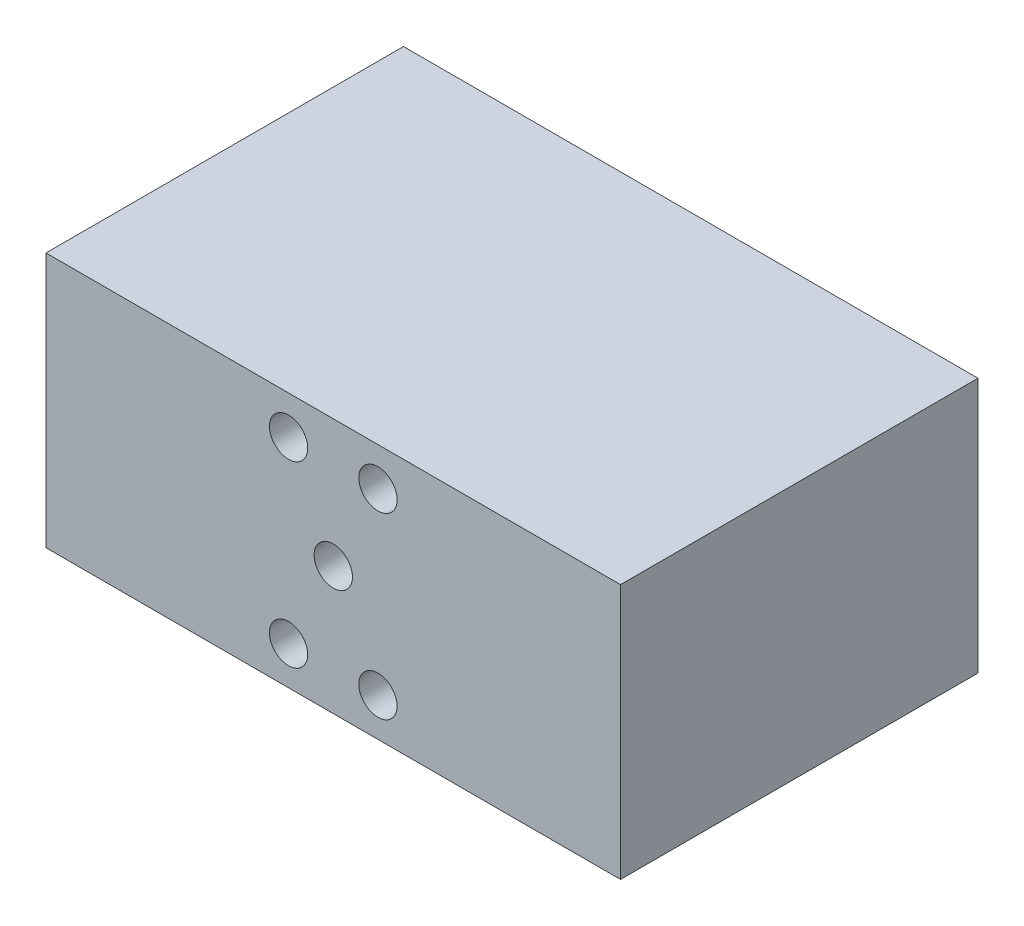
ISO-10303-21;
HEADER;
FILE_DESCRIPTION(('STEP AP214'),'2;1');
FILE_NAME('part.step','',(''),(''),'','','');
FILE_SCHEMA(('AUTOMOTIVE_DESIGN { 1 0 10303 214 1 1 1 1 }'));
ENDSEC;
DATA;
#1=APPLICATION_CONTEXT('core data for automotive mechanical design processes');
#2=APPLICATION_PROTOCOL_DEFINITION('international standard','automotive_design',2000,#1);
#3=PRODUCT_CONTEXT('',#1,'mechanical');
#4=PRODUCT('Part','Part','',(#3));
#5=PRODUCT_RELATED_PRODUCT_CATEGORY('part','',(#4));
#6=PRODUCT_DEFINITION_FORMATION('','',#4);
#7=PRODUCT_DEFINITION_CONTEXT('part definition',#1,'design');
#8=PRODUCT_DEFINITION('design','',#6,#7);
#9=PRODUCT_DEFINITION_SHAPE('','',#8);
#10=(LENGTH_UNIT() NAMED_UNIT(*) SI_UNIT(.MILLI.,.METRE.));
#11=(NAMED_UNIT(*) PLANE_ANGLE_UNIT() SI_UNIT($,.RADIAN.));
#12=(NAMED_UNIT(*) SI_UNIT($,.STERADIAN.) SOLID_ANGLE_UNIT());
#13=UNCERTAINTY_MEASURE_WITH_UNIT(LENGTH_MEASURE(1.E-05),#10,'distance_accuracy_value','');
#14=(GEOMETRIC_REPRESENTATION_CONTEXT(3) GLOBAL_UNCERTAINTY_ASSIGNED_CONTEXT((#13)) GLOBAL_UNIT_ASSIGNED_CONTEXT((#10,
#11,#12)) REPRESENTATION_CONTEXT('',''));
#15=CARTESIAN_POINT('',(0.,0.,0.));
#16=DIRECTION('',(0.,0.,1.));
#17=DIRECTION('',(1.,0.,0.));
#18=AXIS2_PLACEMENT_3D('',#15,#16,#17);
#19=CARTESIAN_POINT('',(0.,0.,-28.));
#20=DIRECTION('',(-1.,0.,0.));
#21=DIRECTION('',(0.,0.,1.));
#22=AXIS2_PLACEMENT_3D('',#19,#20,#21);
#23=PLANE('',#22);
#24=DIRECTION('',(0.,-1.,0.));
#25=VECTOR('',#24,1.);
#26=CARTESIAN_POINT('',(0.,0.,0.));
#27=LINE('',#26,#25);
#28=CARTESIAN_POINT('',(0.,20.,0.));
#29=VERTEX_POINT('',#28);
#30=CARTESIAN_POINT('',(0.,0.,0.));
#31=VERTEX_POINT('',#30);
#32=EDGE_CURVE('E112',#29,#31,#27,.T.);
#33=ORIENTED_EDGE('',*,*,#32,.F.);
#34=DIRECTION('',(0.,0.,1.));
#35=VECTOR('',#34,1.);
#36=CARTESIAN_POINT('',(0.,20.,-28.));
#37=LINE('',#36,#35);
#38=CARTESIAN_POINT('',(0.,20.,-28.));
#39=VERTEX_POINT('',#38);
#40=EDGE_CURVE('E11',#39,#29,#37,.T.);
#41=ORIENTED_EDGE('',*,*,#40,.F.);
#42=DIRECTION('',(0.,-1.,0.));
#43=VECTOR('',#42,1.);
#44=CARTESIAN_POINT('',(0.,0.,-28.));
#45=LINE('',#44,#43);
#46=CARTESIAN_POINT('',(0.,0.,-28.));
#47=VERTEX_POINT('',#46);
#48=EDGE_CURVE('E103',#39,#47,#45,.T.);
#49=ORIENTED_EDGE('',*,*,#48,.T.);
#50=DIRECTION('',(0.,0.,1.));
#51=VECTOR('',#50,1.);
#52=CARTESIAN_POINT('',(0.,0.,-28.));
#53=LINE('',#52,#51);
#54=EDGE_CURVE('E44',#47,#31,#53,.T.);
#55=ORIENTED_EDGE('',*,*,#54,.T.);
#56=EDGE_LOOP('',(#33,#41,#49,#55));
#57=FACE_BOUND('',#56,.T.);
#58=ADVANCED_FACE('F41',(#57),#23,.T.);
#59=CARTESIAN_POINT('',(0.,20.,-28.));
#60=DIRECTION('',(0.,1.,0.));
#61=DIRECTION('',(0.,0.,1.));
#62=AXIS2_PLACEMENT_3D('',#59,#60,#61);
#63=PLANE('',#62);
#64=DIRECTION('',(-1.,0.,0.));
#65=VECTOR('',#64,1.);
#66=CARTESIAN_POINT('',(0.,20.,0.));
#67=LINE('',#66,#65);
#68=CARTESIAN_POINT('',(45.,20.,0.));
#69=VERTEX_POINT('',#68);
#70=EDGE_CURVE('E106',#69,#29,#67,.T.);
#71=ORIENTED_EDGE('',*,*,#70,.F.);
#72=DIRECTION('',(0.,0.,1.));
#73=VECTOR('',#72,1.);
#74=CARTESIAN_POINT('',(45.,20.,-28.));
#75=LINE('',#74,#73);
#76=CARTESIAN_POINT('',(45.,20.,-28.));
#77=VERTEX_POINT('',#76);
#78=EDGE_CURVE('E51',#77,#69,#75,.T.);
#79=ORIENTED_EDGE('',*,*,#78,.F.);
#80=DIRECTION('',(-1.,0.,0.));
#81=VECTOR('',#80,1.);
#82=CARTESIAN_POINT('',(0.,20.,-28.));
#83=LINE('',#82,#81);
#84=EDGE_CURVE('E98',#77,#39,#83,.T.);
#85=ORIENTED_EDGE('',*,*,#84,.T.);
#86=ORIENTED_EDGE('',*,*,#40,.T.);
#87=EDGE_LOOP('',(#71,#79,#85,#86));
#88=FACE_BOUND('',#87,.T.);
#89=ADVANCED_FACE('F129',(#88),#63,.T.);
#90=CARTESIAN_POINT('',(45.,0.,-28.));
#91=DIRECTION('',(1.,0.,0.));
#92=DIRECTION('',(0.,0.,-1.));
#93=AXIS2_PLACEMENT_3D('',#90,#91,#92);
#94=PLANE('',#93);
#95=DIRECTION('',(0.,1.,0.));
#96=VECTOR('',#95,1.);
#97=CARTESIAN_POINT('',(45.,0.,0.));
#98=LINE('',#97,#96);
#99=CARTESIAN_POINT('',(45.,0.,0.));
#100=VERTEX_POINT('',#99);
#101=EDGE_CURVE('E92',#100,#69,#98,.T.);
#102=ORIENTED_EDGE('',*,*,#101,.F.);
#103=DIRECTION('',(0.,0.,1.));
#104=VECTOR('',#103,1.);
#105=CARTESIAN_POINT('',(45.,0.,-28.));
#106=LINE('',#105,#104);
#107=CARTESIAN_POINT('',(45.,0.,-28.));
#108=VERTEX_POINT('',#107);
#109=EDGE_CURVE('E87',#108,#100,#106,.T.);
#110=ORIENTED_EDGE('',*,*,#109,.F.);
#111=DIRECTION('',(0.,1.,0.));
#112=VECTOR('',#111,1.);
#113=CARTESIAN_POINT('',(45.,0.,-28.));
#114=LINE('',#113,#112);
#115=EDGE_CURVE('E90',#108,#77,#114,.T.);
#116=ORIENTED_EDGE('',*,*,#115,.T.);
#117=ORIENTED_EDGE('',*,*,#78,.T.);
#118=EDGE_LOOP('',(#102,#110,#116,#117));
#119=FACE_BOUND('',#118,.T.);
#120=ADVANCED_FACE('F89',(#119),#94,.T.);
#121=CARTESIAN_POINT('',(0.,0.,-28.));
#122=DIRECTION('',(0.,-1.,0.));
#123=DIRECTION('',(0.,0.,-1.));
#124=AXIS2_PLACEMENT_3D('',#121,#122,#123);
#125=PLANE('',#124);
#126=DIRECTION('',(1.,0.,0.));
#127=VECTOR('',#126,1.);
#128=CARTESIAN_POINT('',(0.,0.,0.));
#129=LINE('',#128,#127);
#130=EDGE_CURVE('E116',#31,#100,#129,.T.);
#131=ORIENTED_EDGE('',*,*,#130,.F.);
#132=ORIENTED_EDGE('',*,*,#54,.F.);
#133=DIRECTION('',(1.,0.,0.));
#134=VECTOR('',#133,1.);
#135=CARTESIAN_POINT('',(0.,0.,-28.));
#136=LINE('',#135,#134);
#137=EDGE_CURVE('E97',#47,#108,#136,.T.);
#138=ORIENTED_EDGE('',*,*,#137,.T.);
#139=ORIENTED_EDGE('',*,*,#109,.T.);
#140=EDGE_LOOP('',(#131,#132,#138,#139));
#141=FACE_BOUND('',#140,.T.);
#142=ADVANCED_FACE('F101',(#141),#125,.T.);
#143=CARTESIAN_POINT('',(0.,0.,-28.));
#144=DIRECTION('',(0.,0.,-1.));
#145=DIRECTION('',(-1.,0.,0.));
#146=AXIS2_PLACEMENT_3D('',#143,#144,#145);
#147=PLANE('',#146);
#148=CARTESIAN_POINT('',(26.,17.0000595989715,-28.));
#149=DIRECTION('',(0.,0.,1.));
#150=DIRECTION('',(-1.,0.,0.));
#151=AXIS2_PLACEMENT_3D('',#148,#149,#150);
#152=CIRCLE('',#151,1.5);
#153=CARTESIAN_POINT('',(24.5,17.0000595989715,-28.));
#154=VERTEX_POINT('',#153);
#155=EDGE_CURVE('E208',#154,#154,#152,.T.);
#156=ORIENTED_EDGE('',*,*,#155,.T.);
#157=EDGE_LOOP('',(#156));
#158=FACE_BOUND('',#157,.T.);
#159=CARTESIAN_POINT('',(26.,2.9999404010285,-28.));
#160=DIRECTION('',(0.,0.,1.));
#161=DIRECTION('',(1.,0.,0.));
#162=AXIS2_PLACEMENT_3D('',#159,#160,#161);
#163=CIRCLE('',#162,1.5);
#164=CARTESIAN_POINT('',(27.5,2.9999404010285,-28.));
#165=VERTEX_POINT('',#164);
#166=EDGE_CURVE('E200',#165,#165,#163,.T.);
#167=ORIENTED_EDGE('',*,*,#166,.T.);
#168=EDGE_LOOP('',(#167));
#169=FACE_BOUND('',#168,.T.);
#170=CARTESIAN_POINT('',(19.,17.0000595989715,-28.));
#171=DIRECTION('',(0.,0.,1.));
#172=DIRECTION('',(1.,0.,0.));
#173=AXIS2_PLACEMENT_3D('',#170,#171,#172);
#174=CIRCLE('',#173,1.5);
#175=CARTESIAN_POINT('',(20.5,17.0000595989715,-28.));
#176=VERTEX_POINT('',#175);
#177=EDGE_CURVE('E192',#176,#176,#174,.T.);
#178=ORIENTED_EDGE('',*,*,#177,.T.);
#179=EDGE_LOOP('',(#178));
#180=FACE_BOUND('',#179,.T.);
#181=CARTESIAN_POINT('',(19.,2.9999404010285,-28.));
#182=DIRECTION('',(0.,0.,1.));
#183=DIRECTION('',(-1.,0.,0.));
#184=AXIS2_PLACEMENT_3D('',#181,#182,#183);
#185=CIRCLE('',#184,1.5);
#186=CARTESIAN_POINT('',(17.5,2.9999404010285,-28.));
#187=VERTEX_POINT('',#186);
#188=EDGE_CURVE('E175',#187,#187,#185,.T.);
#189=ORIENTED_EDGE('',*,*,#188,.T.);
#190=EDGE_LOOP('',(#189));
#191=FACE_BOUND('',#190,.T.);
#192=CARTESIAN_POINT('',(22.5,10.0106629879974,-28.));
#193=DIRECTION('',(0.,0.,1.));
#194=DIRECTION('',(1.,0.,0.));
#195=AXIS2_PLACEMENT_3D('',#192,#193,#194);
#196=CIRCLE('',#195,1.5);
#197=CARTESIAN_POINT('',(24.,10.0106629879974,-28.));
#198=VERTEX_POINT('',#197);
#199=EDGE_CURVE('E117',#198,#198,#196,.T.);
#200=ORIENTED_EDGE('',*,*,#199,.T.);
#201=EDGE_LOOP('',(#200));
#202=FACE_BOUND('',#201,.T.);
#203=ORIENTED_EDGE('',*,*,#48,.F.);
#204=ORIENTED_EDGE('',*,*,#84,.F.);
#205=ORIENTED_EDGE('',*,*,#115,.F.);
#206=ORIENTED_EDGE('',*,*,#137,.F.);
#207=EDGE_LOOP('',(#203,#204,#205,#206));
#208=FACE_BOUND('',#207,.T.);
#209=ADVANCED_FACE('F96',(#158,#169,#180,#191,#202,#208),#147,.T.);
#210=CARTESIAN_POINT('',(0.,0.,0.));
#211=DIRECTION('',(0.,0.,-1.));
#212=DIRECTION('',(-1.,0.,0.));
#213=AXIS2_PLACEMENT_3D('',#210,#211,#212);
#214=PLANE('',#213);
#215=CARTESIAN_POINT('',(26.,17.0000595989715,0.));
#216=DIRECTION('',(0.,0.,1.));
#217=DIRECTION('',(-1.,0.,0.));
#218=AXIS2_PLACEMENT_3D('',#215,#216,#217);
#219=CIRCLE('',#218,1.5);
#220=CARTESIAN_POINT('',(24.5,17.0000595989715,0.));
#221=VERTEX_POINT('',#220);
#222=EDGE_CURVE('E204',#221,#221,#219,.T.);
#223=ORIENTED_EDGE('',*,*,#222,.F.);
#224=EDGE_LOOP('',(#223));
#225=FACE_BOUND('',#224,.T.);
#226=CARTESIAN_POINT('',(26.,2.9999404010285,0.));
#227=DIRECTION('',(0.,0.,1.));
#228=DIRECTION('',(1.,0.,0.));
#229=AXIS2_PLACEMENT_3D('',#226,#227,#228);
#230=CIRCLE('',#229,1.5);
#231=CARTESIAN_POINT('',(27.5,2.9999404010285,0.));
#232=VERTEX_POINT('',#231);
#233=EDGE_CURVE('E196',#232,#232,#230,.T.);
#234=ORIENTED_EDGE('',*,*,#233,.F.);
#235=EDGE_LOOP('',(#234));
#236=FACE_BOUND('',#235,.T.);
#237=CARTESIAN_POINT('',(19.,17.0000595989715,0.));
#238=DIRECTION('',(0.,0.,1.));
#239=DIRECTION('',(1.,0.,0.));
#240=AXIS2_PLACEMENT_3D('',#237,#238,#239);
#241=CIRCLE('',#240,1.5);
#242=CARTESIAN_POINT('',(20.5,17.0000595989715,0.));
#243=VERTEX_POINT('',#242);
#244=EDGE_CURVE('E186',#243,#243,#241,.T.);
#245=ORIENTED_EDGE('',*,*,#244,.F.);
#246=EDGE_LOOP('',(#245));
#247=FACE_BOUND('',#246,.T.);
#248=CARTESIAN_POINT('',(19.,2.9999404010285,0.));
#249=DIRECTION('',(0.,0.,1.));
#250=DIRECTION('',(-1.,0.,0.));
#251=AXIS2_PLACEMENT_3D('',#248,#249,#250);
#252=CIRCLE('',#251,1.5);
#253=CARTESIAN_POINT('',(17.5,2.9999404010285,0.));
#254=VERTEX_POINT('',#253);
#255=EDGE_CURVE('E178',#254,#254,#252,.T.);
#256=ORIENTED_EDGE('',*,*,#255,.F.);
#257=EDGE_LOOP('',(#256));
#258=FACE_BOUND('',#257,.T.);
#259=CARTESIAN_POINT('',(22.5,10.0106629879974,0.));
#260=DIRECTION('',(0.,0.,1.));
#261=DIRECTION('',(1.,0.,0.));
#262=AXIS2_PLACEMENT_3D('',#259,#260,#261);
#263=CIRCLE('',#262,1.5);
#264=CARTESIAN_POINT('',(24.,10.0106629879974,0.));
#265=VERTEX_POINT('',#264);
#266=EDGE_CURVE('E181',#265,#265,#263,.T.);
#267=ORIENTED_EDGE('',*,*,#266,.F.);
#268=EDGE_LOOP('',(#267));
#269=FACE_BOUND('',#268,.T.);
#270=ORIENTED_EDGE('',*,*,#32,.T.);
#271=ORIENTED_EDGE('',*,*,#130,.T.);
#272=ORIENTED_EDGE('',*,*,#101,.T.);
#273=ORIENTED_EDGE('',*,*,#70,.T.);
#274=EDGE_LOOP('',(#270,#271,#272,#273));
#275=FACE_BOUND('',#274,.T.);
#276=ADVANCED_FACE('F128',(#225,#236,#247,#258,#269,#275),#214,.F.);
#277=CARTESIAN_POINT('',(22.5,10.0106629879974,-28.));
#278=DIRECTION('',(0.,0.,1.));
#279=DIRECTION('',(1.,0.,0.));
#280=AXIS2_PLACEMENT_3D('',#277,#278,#279);
#281=CYLINDRICAL_SURFACE('',#280,1.5);
#282=ORIENTED_EDGE('',*,*,#199,.F.);
#283=EDGE_LOOP('',(#282));
#284=FACE_BOUND('',#283,.T.);
#285=ORIENTED_EDGE('',*,*,#266,.T.);
#286=EDGE_LOOP('',(#285));
#287=FACE_BOUND('',#286,.T.);
#288=ADVANCED_FACE('F147',(#284,#287),#281,.F.);
#289=CARTESIAN_POINT('',(19.,2.9999404010285,-28.));
#290=DIRECTION('',(0.,0.,1.));
#291=DIRECTION('',(1.,0.,0.));
#292=AXIS2_PLACEMENT_3D('',#289,#290,#291);
#293=CYLINDRICAL_SURFACE('',#292,1.5);
#294=ORIENTED_EDGE('',*,*,#188,.F.);
#295=EDGE_LOOP('',(#294));
#296=FACE_BOUND('',#295,.T.);
#297=ORIENTED_EDGE('',*,*,#255,.T.);
#298=EDGE_LOOP('',(#297));
#299=FACE_BOUND('',#298,.T.);
#300=ADVANCED_FACE('F154',(#296,#299),#293,.F.);
#301=CARTESIAN_POINT('',(19.,17.0000595989715,-28.));
#302=DIRECTION('',(0.,0.,1.));
#303=DIRECTION('',(1.,0.,0.));
#304=AXIS2_PLACEMENT_3D('',#301,#302,#303);
#305=CYLINDRICAL_SURFACE('',#304,1.5);
#306=ORIENTED_EDGE('',*,*,#177,.F.);
#307=EDGE_LOOP('',(#306));
#308=FACE_BOUND('',#307,.T.);
#309=ORIENTED_EDGE('',*,*,#244,.T.);
#310=EDGE_LOOP('',(#309));
#311=FACE_BOUND('',#310,.T.);
#312=ADVANCED_FACE('F163',(#308,#311),#305,.F.);
#313=CARTESIAN_POINT('',(26.,2.9999404010285,-28.));
#314=DIRECTION('',(0.,0.,1.));
#315=DIRECTION('',(1.,0.,0.));
#316=AXIS2_PLACEMENT_3D('',#313,#314,#315);
#317=CYLINDRICAL_SURFACE('',#316,1.5);
#318=ORIENTED_EDGE('',*,*,#166,.F.);
#319=EDGE_LOOP('',(#318));
#320=FACE_BOUND('',#319,.T.);
#321=ORIENTED_EDGE('',*,*,#233,.T.);
#322=EDGE_LOOP('',(#321));
#323=FACE_BOUND('',#322,.T.);
#324=ADVANCED_FACE('F159',(#320,#323),#317,.F.);
#325=CARTESIAN_POINT('',(26.,17.0000595989715,-28.));
#326=DIRECTION('',(0.,0.,1.));
#327=DIRECTION('',(1.,0.,0.));
#328=AXIS2_PLACEMENT_3D('',#325,#326,#327);
#329=CYLINDRICAL_SURFACE('',#328,1.5);
#330=ORIENTED_EDGE('',*,*,#155,.F.);
#331=EDGE_LOOP('',(#330));
#332=FACE_BOUND('',#331,.T.);
#333=ORIENTED_EDGE('',*,*,#222,.T.);
#334=EDGE_LOOP('',(#333));
#335=FACE_BOUND('',#334,.T.);
#336=ADVANCED_FACE('F156',(#332,#335),#329,.F.);
#337=CLOSED_SHELL('',(#58,#89,#120,#142,#209,#276,#288,#300,#312,#324,#336));
#338=MANIFOLD_SOLID_BREP('B2',#337);
#339=ADVANCED_BREP_SHAPE_REPRESENTATION('',(#18,#338),#14);
#340=SHAPE_DEFINITION_REPRESENTATION(#9,#339);
ENDSEC;
END-ISO-10303-21;
